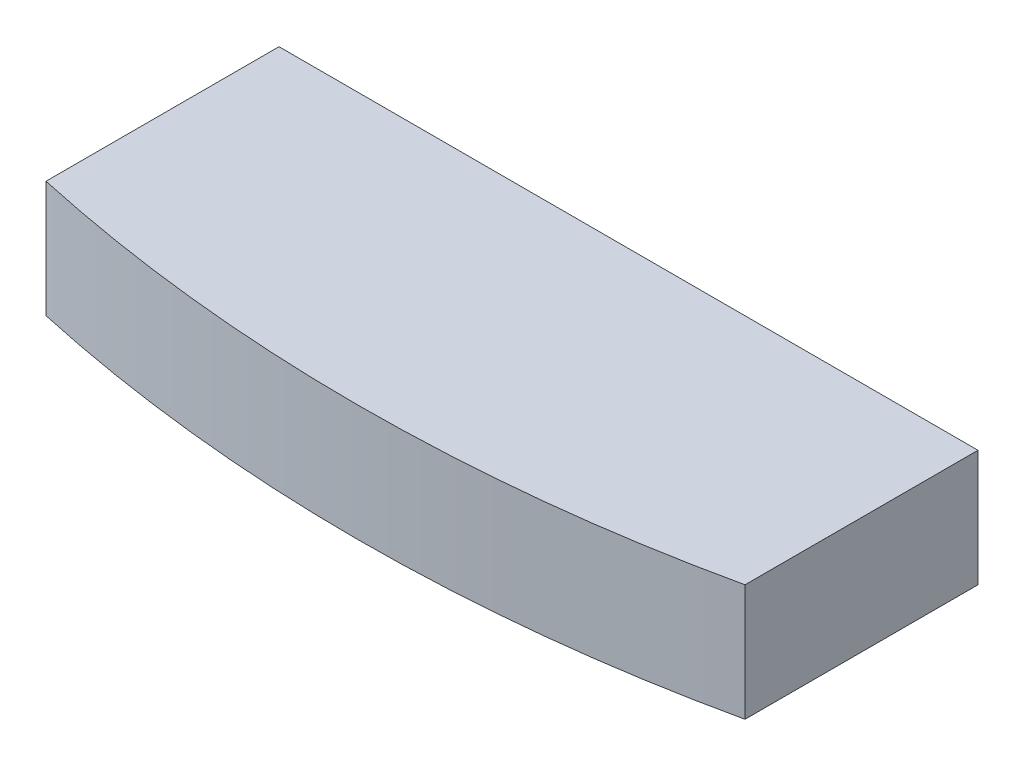
ISO-10303-21;
HEADER;
FILE_DESCRIPTION(('STEP AP214'),'2;1');
FILE_NAME('part.step','',(''),(''),'','','');
FILE_SCHEMA(('AUTOMOTIVE_DESIGN { 1 0 10303 214 1 1 1 1 }'));
ENDSEC;
DATA;
#1=APPLICATION_CONTEXT('core data for automotive mechanical design processes');
#2=APPLICATION_PROTOCOL_DEFINITION('international standard','automotive_design',2000,#1);
#3=PRODUCT_CONTEXT('',#1,'mechanical');
#4=PRODUCT('Part','Part','',(#3));
#5=PRODUCT_RELATED_PRODUCT_CATEGORY('part','',(#4));
#6=PRODUCT_DEFINITION_FORMATION('','',#4);
#7=PRODUCT_DEFINITION_CONTEXT('part definition',#1,'design');
#8=PRODUCT_DEFINITION('design','',#6,#7);
#9=PRODUCT_DEFINITION_SHAPE('','',#8);
#10=(LENGTH_UNIT() NAMED_UNIT(*) SI_UNIT(.MILLI.,.METRE.));
#11=(NAMED_UNIT(*) PLANE_ANGLE_UNIT() SI_UNIT($,.RADIAN.));
#12=(NAMED_UNIT(*) SI_UNIT($,.STERADIAN.) SOLID_ANGLE_UNIT());
#13=UNCERTAINTY_MEASURE_WITH_UNIT(LENGTH_MEASURE(1.E-05),#10,'distance_accuracy_value','');
#14=(GEOMETRIC_REPRESENTATION_CONTEXT(3) GLOBAL_UNCERTAINTY_ASSIGNED_CONTEXT((#13)) GLOBAL_UNIT_ASSIGNED_CONTEXT((#10,
#11,#12)) REPRESENTATION_CONTEXT('',''));
#15=CARTESIAN_POINT('',(0.,0.,0.));
#16=DIRECTION('',(0.,0.,1.));
#17=DIRECTION('',(1.,0.,0.));
#18=AXIS2_PLACEMENT_3D('',#15,#16,#17);
#19=CARTESIAN_POINT('',(0.,12.7,0.));
#20=DIRECTION('',(0.,-1.,0.));
#21=DIRECTION('',(0.,0.,-1.));
#22=AXIS2_PLACEMENT_3D('',#19,#20,#21);
#23=CYLINDRICAL_SURFACE('',#22,177.546);
#24=CARTESIAN_POINT('',(0.,0.,0.));
#25=DIRECTION('',(0.,1.,0.));
#26=DIRECTION('',(0.,0.,-1.));
#27=AXIS2_PLACEMENT_3D('',#24,#25,#26);
#28=CIRCLE('',#27,177.546);
#29=CARTESIAN_POINT('',(-38.1,0.,173.409838579015));
#30=VERTEX_POINT('',#29);
#31=CARTESIAN_POINT('',(38.1,0.,173.409838579015));
#32=VERTEX_POINT('',#31);
#33=EDGE_CURVE('E83',#30,#32,#28,.T.);
#34=ORIENTED_EDGE('',*,*,#33,.T.);
#35=DIRECTION('',(0.,-1.,0.));
#36=VECTOR('',#35,1.);
#37=CARTESIAN_POINT('',(38.1,12.7,173.409838579015));
#38=LINE('',#37,#36);
#39=CARTESIAN_POINT('',(38.1,12.7,173.409838579015));
#40=VERTEX_POINT('',#39);
#41=EDGE_CURVE('E90',#40,#32,#38,.T.);
#42=ORIENTED_EDGE('',*,*,#41,.F.);
#43=CARTESIAN_POINT('',(0.,12.7,0.));
#44=DIRECTION('',(0.,1.,0.));
#45=DIRECTION('',(0.,0.,-1.));
#46=AXIS2_PLACEMENT_3D('',#43,#44,#45);
#47=CIRCLE('',#46,177.546);
#48=CARTESIAN_POINT('',(-38.1,12.7,173.409838579015));
#49=VERTEX_POINT('',#48);
#50=EDGE_CURVE('E100',#49,#40,#47,.T.);
#51=ORIENTED_EDGE('',*,*,#50,.F.);
#52=DIRECTION('',(0.,-1.,0.));
#53=VECTOR('',#52,1.);
#54=CARTESIAN_POINT('',(-38.1,12.7,173.409838579015));
#55=LINE('',#54,#53);
#56=EDGE_CURVE('E44',#49,#30,#55,.T.);
#57=ORIENTED_EDGE('',*,*,#56,.T.);
#58=EDGE_LOOP('',(#34,#42,#51,#57));
#59=FACE_BOUND('',#58,.T.);
#60=ADVANCED_FACE('F36',(#59),#23,.T.);
#61=CARTESIAN_POINT('',(-38.1,12.7,148.009838579015));
#62=DIRECTION('',(0.,0.,1.));
#63=DIRECTION('',(1.,0.,0.));
#64=AXIS2_PLACEMENT_3D('',#61,#62,#63);
#65=PLANE('',#64);
#66=DIRECTION('',(-1.,0.,0.));
#67=VECTOR('',#66,1.);
#68=CARTESIAN_POINT('',(-38.1,0.,148.009838579015));
#69=LINE('',#68,#67);
#70=CARTESIAN_POINT('',(38.1,0.,148.009838579015));
#71=VERTEX_POINT('',#70);
#72=CARTESIAN_POINT('',(-38.1,0.,148.009838579015));
#73=VERTEX_POINT('',#72);
#74=EDGE_CURVE('E63',#71,#73,#69,.T.);
#75=ORIENTED_EDGE('',*,*,#74,.T.);
#76=DIRECTION('',(0.,-1.,0.));
#77=VECTOR('',#76,1.);
#78=CARTESIAN_POINT('',(-38.1,12.7,148.009838579015));
#79=LINE('',#78,#77);
#80=CARTESIAN_POINT('',(-38.1,12.7,148.009838579015));
#81=VERTEX_POINT('',#80);
#82=EDGE_CURVE('E11',#81,#73,#79,.T.);
#83=ORIENTED_EDGE('',*,*,#82,.F.);
#84=DIRECTION('',(-1.,0.,0.));
#85=VECTOR('',#84,1.);
#86=CARTESIAN_POINT('',(-38.1,12.7,148.009838579015));
#87=LINE('',#86,#85);
#88=CARTESIAN_POINT('',(38.1,12.7,148.009838579015));
#89=VERTEX_POINT('',#88);
#90=EDGE_CURVE('E68',#89,#81,#87,.T.);
#91=ORIENTED_EDGE('',*,*,#90,.F.);
#92=DIRECTION('',(0.,-1.,0.));
#93=VECTOR('',#92,1.);
#94=CARTESIAN_POINT('',(38.1,12.7,148.009838579015));
#95=LINE('',#94,#93);
#96=EDGE_CURVE('E85',#89,#71,#95,.T.);
#97=ORIENTED_EDGE('',*,*,#96,.T.);
#98=EDGE_LOOP('',(#75,#83,#91,#97));
#99=FACE_BOUND('',#98,.T.);
#100=ADVANCED_FACE('F86',(#99),#65,.F.);
#101=CARTESIAN_POINT('',(-38.1,12.7,173.409838579015));
#102=DIRECTION('',(1.,0.,0.));
#103=DIRECTION('',(0.,0.,-1.));
#104=AXIS2_PLACEMENT_3D('',#101,#102,#103);
#105=PLANE('',#104);
#106=DIRECTION('',(0.,0.,1.));
#107=VECTOR('',#106,1.);
#108=CARTESIAN_POINT('',(-38.1,0.,173.409838579015));
#109=LINE('',#108,#107);
#110=EDGE_CURVE('E82',#73,#30,#109,.T.);
#111=ORIENTED_EDGE('',*,*,#110,.T.);
#112=ORIENTED_EDGE('',*,*,#56,.F.);
#113=DIRECTION('',(0.,0.,1.));
#114=VECTOR('',#113,1.);
#115=CARTESIAN_POINT('',(-38.1,12.7,173.409838579015));
#116=LINE('',#115,#114);
#117=EDGE_CURVE('E52',#81,#49,#116,.T.);
#118=ORIENTED_EDGE('',*,*,#117,.F.);
#119=ORIENTED_EDGE('',*,*,#82,.T.);
#120=EDGE_LOOP('',(#111,#112,#118,#119));
#121=FACE_BOUND('',#120,.T.);
#122=ADVANCED_FACE('F109',(#121),#105,.F.);
#123=CARTESIAN_POINT('',(0.,12.7,0.));
#124=DIRECTION('',(0.,-1.,0.));
#125=DIRECTION('',(0.,0.,-1.));
#126=AXIS2_PLACEMENT_3D('',#123,#124,#125);
#127=PLANE('',#126);
#128=ORIENTED_EDGE('',*,*,#50,.T.);
#129=DIRECTION('',(0.,0.,1.));
#130=VECTOR('',#129,1.);
#131=CARTESIAN_POINT('',(38.1,12.7,173.409838579015));
#132=LINE('',#131,#130);
#133=EDGE_CURVE('E91',#89,#40,#132,.T.);
#134=ORIENTED_EDGE('',*,*,#133,.F.);
#135=ORIENTED_EDGE('',*,*,#90,.T.);
#136=ORIENTED_EDGE('',*,*,#117,.T.);
#137=EDGE_LOOP('',(#128,#134,#135,#136));
#138=FACE_BOUND('',#137,.T.);
#139=ADVANCED_FACE('F111',(#138),#127,.F.);
#140=CARTESIAN_POINT('',(0.,0.,0.));
#141=DIRECTION('',(0.,-1.,0.));
#142=DIRECTION('',(0.,0.,-1.));
#143=AXIS2_PLACEMENT_3D('',#140,#141,#142);
#144=PLANE('',#143);
#145=ORIENTED_EDGE('',*,*,#33,.F.);
#146=ORIENTED_EDGE('',*,*,#110,.F.);
#147=ORIENTED_EDGE('',*,*,#74,.F.);
#148=DIRECTION('',(0.,0.,1.));
#149=VECTOR('',#148,1.);
#150=CARTESIAN_POINT('',(38.1,0.,173.409838579015));
#151=LINE('',#150,#149);
#152=EDGE_CURVE('E81',#71,#32,#151,.T.);
#153=ORIENTED_EDGE('',*,*,#152,.T.);
#154=EDGE_LOOP('',(#145,#146,#147,#153));
#155=FACE_BOUND('',#154,.T.);
#156=ADVANCED_FACE('F79',(#155),#144,.T.);
#157=CARTESIAN_POINT('',(38.1,12.7,173.409838579015));
#158=DIRECTION('',(1.,0.,0.));
#159=DIRECTION('',(0.,0.,-1.));
#160=AXIS2_PLACEMENT_3D('',#157,#158,#159);
#161=PLANE('',#160);
#162=ORIENTED_EDGE('',*,*,#152,.F.);
#163=ORIENTED_EDGE('',*,*,#96,.F.);
#164=ORIENTED_EDGE('',*,*,#133,.T.);
#165=ORIENTED_EDGE('',*,*,#41,.T.);
#166=EDGE_LOOP('',(#162,#163,#164,#165));
#167=FACE_BOUND('',#166,.T.);
#168=ADVANCED_FACE('F94',(#167),#161,.T.);
#169=CLOSED_SHELL('',(#60,#100,#122,#139,#156,#168));
#170=MANIFOLD_SOLID_BREP('B2',#169);
#171=ADVANCED_BREP_SHAPE_REPRESENTATION('',(#18,#170),#14);
#172=SHAPE_DEFINITION_REPRESENTATION(#9,#171);
ENDSEC;
END-ISO-10303-21;
